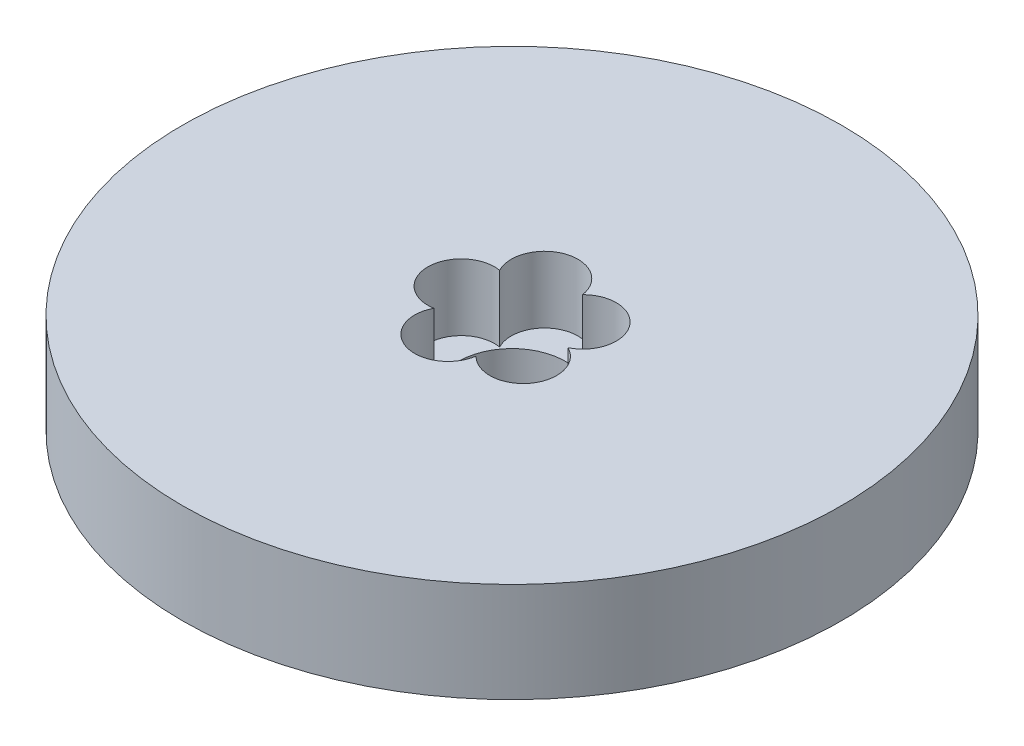
ISO-10303-21;
HEADER;
FILE_DESCRIPTION(('STEP AP214'),'2;1');
FILE_NAME('part.step','',(''),(''),'','','');
FILE_SCHEMA(('AUTOMOTIVE_DESIGN { 1 0 10303 214 1 1 1 1 }'));
ENDSEC;
DATA;
#1=APPLICATION_CONTEXT('core data for automotive mechanical design processes');
#2=APPLICATION_PROTOCOL_DEFINITION('international standard','automotive_design',2000,#1);
#3=PRODUCT_CONTEXT('',#1,'mechanical');
#4=PRODUCT('Part','Part','',(#3));
#5=PRODUCT_RELATED_PRODUCT_CATEGORY('part','',(#4));
#6=PRODUCT_DEFINITION_FORMATION('','',#4);
#7=PRODUCT_DEFINITION_CONTEXT('part definition',#1,'design');
#8=PRODUCT_DEFINITION('design','',#6,#7);
#9=PRODUCT_DEFINITION_SHAPE('','',#8);
#10=(LENGTH_UNIT() NAMED_UNIT(*) SI_UNIT(.MILLI.,.METRE.));
#11=(NAMED_UNIT(*) PLANE_ANGLE_UNIT() SI_UNIT($,.RADIAN.));
#12=(NAMED_UNIT(*) SI_UNIT($,.STERADIAN.) SOLID_ANGLE_UNIT());
#13=UNCERTAINTY_MEASURE_WITH_UNIT(LENGTH_MEASURE(1.E-05),#10,'distance_accuracy_value','');
#14=(GEOMETRIC_REPRESENTATION_CONTEXT(3) GLOBAL_UNCERTAINTY_ASSIGNED_CONTEXT((#13)) GLOBAL_UNIT_ASSIGNED_CONTEXT((#10,
#11,#12)) REPRESENTATION_CONTEXT('',''));
#15=CARTESIAN_POINT('',(0.,0.,0.));
#16=DIRECTION('',(0.,0.,1.));
#17=DIRECTION('',(1.,0.,0.));
#18=AXIS2_PLACEMENT_3D('',#15,#16,#17);
#19=CARTESIAN_POINT('',(0.,28.,0.));
#20=DIRECTION('',(0.,-1.,0.));
#21=DIRECTION('',(0.,0.,-1.));
#22=AXIS2_PLACEMENT_3D('',#19,#20,#21);
#23=CYLINDRICAL_SURFACE('',#22,15.);
#24=CARTESIAN_POINT('',(0.,0.,0.));
#25=DIRECTION('',(0.,1.,0.));
#26=DIRECTION('',(0.,0.,1.));
#27=AXIS2_PLACEMENT_3D('',#24,#25,#26);
#28=CIRCLE('',#27,15.);
#29=CARTESIAN_POINT('',(0.,0.,15.));
#30=VERTEX_POINT('',#29);
#31=EDGE_CURVE('E129',#30,#30,#28,.T.);
#32=ORIENTED_EDGE('',*,*,#31,.F.);
#33=EDGE_LOOP('',(#32));
#34=FACE_BOUND('',#33,.T.);
#35=CARTESIAN_POINT('',(0.,9.34154381881042,0.));
#36=DIRECTION('',(0.,1.,0.));
#37=DIRECTION('',(0.,0.,1.));
#38=AXIS2_PLACEMENT_3D('',#35,#36,#37);
#39=CIRCLE('',#38,15.);
#40=CARTESIAN_POINT('',(0.,9.34154381881042,15.));
#41=VERTEX_POINT('',#40);
#42=EDGE_CURVE('E11',#41,#41,#39,.T.);
#43=ORIENTED_EDGE('',*,*,#42,.T.);
#44=EDGE_LOOP('',(#43));
#45=FACE_BOUND('',#44,.T.);
#46=ADVANCED_FACE('F39',(#34,#45),#23,.F.);
#47=CARTESIAN_POINT('',(0.,28.,0.));
#48=DIRECTION('',(0.,-1.,0.));
#49=DIRECTION('',(0.,0.,-1.));
#50=AXIS2_PLACEMENT_3D('',#47,#48,#49);
#51=CYLINDRICAL_SURFACE('',#50,92.5);
#52=CARTESIAN_POINT('',(0.,28.,0.));
#53=DIRECTION('',(0.,1.,0.));
#54=DIRECTION('',(0.,0.,1.));
#55=AXIS2_PLACEMENT_3D('',#52,#53,#54);
#56=CIRCLE('',#55,92.5);
#57=CARTESIAN_POINT('',(0.,28.,92.5));
#58=VERTEX_POINT('',#57);
#59=EDGE_CURVE('E50',#58,#58,#56,.T.);
#60=ORIENTED_EDGE('',*,*,#59,.F.);
#61=EDGE_LOOP('',(#60));
#62=FACE_BOUND('',#61,.T.);
#63=CARTESIAN_POINT('',(0.,0.,0.));
#64=DIRECTION('',(0.,1.,0.));
#65=DIRECTION('',(0.,0.,1.));
#66=AXIS2_PLACEMENT_3D('',#63,#64,#65);
#67=CIRCLE('',#66,92.5);
#68=CARTESIAN_POINT('',(0.,0.,92.5));
#69=VERTEX_POINT('',#68);
#70=EDGE_CURVE('E133',#69,#69,#67,.T.);
#71=ORIENTED_EDGE('',*,*,#70,.T.);
#72=EDGE_LOOP('',(#71));
#73=FACE_BOUND('',#72,.T.);
#74=ADVANCED_FACE('F41',(#62,#73),#51,.T.);
#75=CARTESIAN_POINT('',(0.,28.,0.));
#76=DIRECTION('',(0.,1.,0.));
#77=DIRECTION('',(0.,0.,1.));
#78=AXIS2_PLACEMENT_3D('',#75,#76,#77);
#79=PLANE('',#78);
#80=CARTESIAN_POINT('',(-4.40344690659952,28.,13.5524160512668));
#81=DIRECTION('',(0.,1.,0.));
#82=DIRECTION('',(0.951056516295155,0.,0.309016994374945));
#83=AXIS2_PLACEMENT_3D('',#80,#81,#82);
#84=CIRCLE('',#83,9.36636293219436);
#85=CARTESIAN_POINT('',(-12.718142529262,28.,9.24027142474254));
#86=VERTEX_POINT('',#85);
#87=CARTESIAN_POINT('',(4.8578981724126,28.,14.9510732305078));
#88=VERTEX_POINT('',#87);
#89=EDGE_CURVE('E119',#86,#88,#84,.T.);
#90=ORIENTED_EDGE('',*,*,#89,.F.);
#91=CARTESIAN_POINT('',(-14.2498535250673,28.,0.));
#92=DIRECTION('',(0.,1.,0.));
#93=DIRECTION('',(0.,0.,1.));
#94=AXIS2_PLACEMENT_3D('',#91,#92,#93);
#95=CIRCLE('',#94,9.36636293219436);
#96=CARTESIAN_POINT('',(-12.7181425292622,28.,-9.24027142474258));
#97=VERTEX_POINT('',#96);
#98=EDGE_CURVE('E127',#97,#86,#95,.T.);
#99=ORIENTED_EDGE('',*,*,#98,.F.);
#100=CARTESIAN_POINT('',(-4.40344690659971,28.,-13.5524160512667));
#101=DIRECTION('',(0.,1.,0.));
#102=DIRECTION('',(-0.95105651629515,0.,0.309016994374958));
#103=AXIS2_PLACEMENT_3D('',#100,#101,#102);
#104=CIRCLE('',#103,9.36636293219436);
#105=CARTESIAN_POINT('',(4.85789817241239,28.,-14.9510732305079));
#106=VERTEX_POINT('',#105);
#107=EDGE_CURVE('E53',#106,#97,#104,.T.);
#108=ORIENTED_EDGE('',*,*,#107,.F.);
#109=CARTESIAN_POINT('',(11.5283736691331,28.,-8.37585374936259));
#110=DIRECTION('',(0.,1.,0.));
#111=DIRECTION('',(-0.58778525229248,0.,-0.809016994374942));
#112=AXIS2_PLACEMENT_3D('',#109,#110,#111);
#113=CIRCLE('',#112,9.36636293219436);
#114=CARTESIAN_POINT('',(15.720488713699,28.,-1.14491749414469E-13));
#115=VERTEX_POINT('',#114);
#116=EDGE_CURVE('E99',#115,#106,#113,.T.);
#117=ORIENTED_EDGE('',*,*,#116,.F.);
#118=CARTESIAN_POINT('',(11.5283736691333,28.,8.37585374936242));
#119=DIRECTION('',(0.,1.,0.));
#120=DIRECTION('',(0.587785252292469,0.,-0.809016994374951));
#121=AXIS2_PLACEMENT_3D('',#118,#119,#120);
#122=CIRCLE('',#121,9.36636293219436);
#123=EDGE_CURVE('E113',#88,#115,#122,.T.);
#124=ORIENTED_EDGE('',*,*,#123,.F.);
#125=EDGE_LOOP('',(#90,#99,#108,#117,#124));
#126=FACE_BOUND('',#125,.T.);
#127=ORIENTED_EDGE('',*,*,#59,.T.);
#128=EDGE_LOOP('',(#127));
#129=FACE_BOUND('',#128,.T.);
#130=ADVANCED_FACE('F141',(#126,#129),#79,.T.);
#131=CARTESIAN_POINT('',(0.,0.,0.));
#132=DIRECTION('',(0.,1.,0.));
#133=DIRECTION('',(0.,0.,1.));
#134=AXIS2_PLACEMENT_3D('',#131,#132,#133);
#135=PLANE('',#134);
#136=ORIENTED_EDGE('',*,*,#31,.T.);
#137=EDGE_LOOP('',(#136));
#138=FACE_BOUND('',#137,.T.);
#139=ORIENTED_EDGE('',*,*,#70,.F.);
#140=EDGE_LOOP('',(#139));
#141=FACE_BOUND('',#140,.T.);
#142=ADVANCED_FACE('F139',(#138,#141),#135,.F.);
#143=CARTESIAN_POINT('',(-14.2498535250673,9.34154381881042,0.));
#144=DIRECTION('',(0.,1.,0.));
#145=DIRECTION('',(0.,0.,1.));
#146=AXIS2_PLACEMENT_3D('',#143,#144,#145);
#147=CYLINDRICAL_SURFACE('',#146,9.36636293219436);
#148=ORIENTED_EDGE('',*,*,#98,.T.);
#149=DIRECTION('',(0.,1.,0.));
#150=VECTOR('',#149,1.);
#151=CARTESIAN_POINT('',(-12.718142529262,18.6707719094052,9.24027142474254));
#152=LINE('',#151,#150);
#153=CARTESIAN_POINT('',(-12.718142529262,9.34154381881042,9.24027142474254));
#154=VERTEX_POINT('',#153);
#155=EDGE_CURVE('E65',#86,#154,#152,.F.);
#156=ORIENTED_EDGE('',*,*,#155,.T.);
#157=CARTESIAN_POINT('',(-14.2498535250673,9.34154381881042,0.));
#158=DIRECTION('',(0.,1.,0.));
#159=DIRECTION('',(0.,0.,1.));
#160=AXIS2_PLACEMENT_3D('',#157,#158,#159);
#161=CIRCLE('',#160,9.36636293219436);
#162=CARTESIAN_POINT('',(-12.7181425292623,9.34154381881042,-9.24027142474258));
#163=VERTEX_POINT('',#162);
#164=EDGE_CURVE('E130',#163,#154,#161,.T.);
#165=ORIENTED_EDGE('',*,*,#164,.F.);
#166=DIRECTION('',(0.,1.,0.));
#167=VECTOR('',#166,1.);
#168=CARTESIAN_POINT('',(-12.7181425292623,18.6707719094052,-9.24027142474258));
#169=LINE('',#168,#167);
#170=EDGE_CURVE('E108',#163,#97,#169,.T.);
#171=ORIENTED_EDGE('',*,*,#170,.T.);
#172=EDGE_LOOP('',(#148,#156,#165,#171));
#173=FACE_BOUND('',#172,.T.);
#174=ADVANCED_FACE('F142',(#173),#147,.F.);
#175=CARTESIAN_POINT('',(-14.2498535250673,9.34154381881042,0.));
#176=DIRECTION('',(0.,1.,0.));
#177=DIRECTION('',(0.,0.,1.));
#178=AXIS2_PLACEMENT_3D('',#175,#176,#177);
#179=PLANE('',#178);
#180=ORIENTED_EDGE('',*,*,#164,.T.);
#181=CARTESIAN_POINT('',(-4.40344690659952,9.34154381881042,13.5524160512668));
#182=DIRECTION('',(0.,1.,0.));
#183=DIRECTION('',(0.951056516295155,0.,0.309016994374945));
#184=AXIS2_PLACEMENT_3D('',#181,#182,#183);
#185=CIRCLE('',#184,9.36636293219436);
#186=CARTESIAN_POINT('',(4.8578981724126,9.34154381881042,14.9510732305078));
#187=VERTEX_POINT('',#186);
#188=EDGE_CURVE('E121',#154,#187,#185,.T.);
#189=ORIENTED_EDGE('',*,*,#188,.T.);
#190=CARTESIAN_POINT('',(11.5283736691333,9.34154381881042,8.37585374936242));
#191=DIRECTION('',(0.,1.,0.));
#192=DIRECTION('',(0.587785252292469,0.,-0.809016994374951));
#193=AXIS2_PLACEMENT_3D('',#190,#191,#192);
#194=CIRCLE('',#193,9.36636293219436);
#195=CARTESIAN_POINT('',(15.720488713699,9.34154381881042,-1.14491749414469E-13));
#196=VERTEX_POINT('',#195);
#197=EDGE_CURVE('E92',#187,#196,#194,.T.);
#198=ORIENTED_EDGE('',*,*,#197,.T.);
#199=CARTESIAN_POINT('',(11.5283736691331,9.34154381881042,-8.37585374936259));
#200=DIRECTION('',(0.,1.,0.));
#201=DIRECTION('',(-0.58778525229248,0.,-0.809016994374942));
#202=AXIS2_PLACEMENT_3D('',#199,#200,#201);
#203=CIRCLE('',#202,9.36636293219436);
#204=CARTESIAN_POINT('',(4.85789817241239,9.34154381881042,-14.9510732305079));
#205=VERTEX_POINT('',#204);
#206=EDGE_CURVE('E88',#196,#205,#203,.T.);
#207=ORIENTED_EDGE('',*,*,#206,.T.);
#208=CARTESIAN_POINT('',(-4.40344690659971,9.34154381881042,-13.5524160512667));
#209=DIRECTION('',(0.,1.,0.));
#210=DIRECTION('',(-0.95105651629515,0.,0.309016994374958));
#211=AXIS2_PLACEMENT_3D('',#208,#209,#210);
#212=CIRCLE('',#211,9.36636293219436);
#213=EDGE_CURVE('E95',#205,#163,#212,.T.);
#214=ORIENTED_EDGE('',*,*,#213,.T.);
#215=EDGE_LOOP('',(#180,#189,#198,#207,#214));
#216=FACE_BOUND('',#215,.T.);
#217=ORIENTED_EDGE('',*,*,#42,.F.);
#218=EDGE_LOOP('',(#217));
#219=FACE_BOUND('',#218,.T.);
#220=ADVANCED_FACE('F90',(#216,#219),#179,.T.);
#221=CARTESIAN_POINT('',(-4.40344690659952,9.34154381881042,13.5524160512668));
#222=DIRECTION('',(0.,1.,0.));
#223=DIRECTION('',(0.,0.,1.));
#224=AXIS2_PLACEMENT_3D('',#221,#222,#223);
#225=CYLINDRICAL_SURFACE('',#224,9.36636293219436);
#226=ORIENTED_EDGE('',*,*,#89,.T.);
#227=DIRECTION('',(0.,1.,0.));
#228=VECTOR('',#227,1.);
#229=CARTESIAN_POINT('',(4.8578981724126,18.6707719094052,14.9510732305078));
#230=LINE('',#229,#228);
#231=EDGE_CURVE('E106',#88,#187,#230,.F.);
#232=ORIENTED_EDGE('',*,*,#231,.T.);
#233=ORIENTED_EDGE('',*,*,#188,.F.);
#234=ORIENTED_EDGE('',*,*,#155,.F.);
#235=EDGE_LOOP('',(#226,#232,#233,#234));
#236=FACE_BOUND('',#235,.T.);
#237=ADVANCED_FACE('F164',(#236),#225,.F.);
#238=CARTESIAN_POINT('',(-4.40344690659971,9.34154381881042,-13.5524160512667));
#239=DIRECTION('',(0.,1.,0.));
#240=DIRECTION('',(0.,0.,1.));
#241=AXIS2_PLACEMENT_3D('',#238,#239,#240);
#242=CYLINDRICAL_SURFACE('',#241,9.36636293219436);
#243=ORIENTED_EDGE('',*,*,#213,.F.);
#244=DIRECTION('',(0.,1.,0.));
#245=VECTOR('',#244,1.);
#246=CARTESIAN_POINT('',(4.85789817241239,18.6707719094052,-14.9510732305079));
#247=LINE('',#246,#245);
#248=EDGE_CURVE('E103',#106,#205,#247,.F.);
#249=ORIENTED_EDGE('',*,*,#248,.F.);
#250=ORIENTED_EDGE('',*,*,#107,.T.);
#251=ORIENTED_EDGE('',*,*,#170,.F.);
#252=EDGE_LOOP('',(#243,#249,#250,#251));
#253=FACE_BOUND('',#252,.T.);
#254=ADVANCED_FACE('F107',(#253),#242,.F.);
#255=CARTESIAN_POINT('',(11.5283736691333,9.34154381881042,8.37585374936242));
#256=DIRECTION('',(0.,1.,0.));
#257=DIRECTION('',(0.,0.,1.));
#258=AXIS2_PLACEMENT_3D('',#255,#256,#257);
#259=CYLINDRICAL_SURFACE('',#258,9.36636293219436);
#260=ORIENTED_EDGE('',*,*,#123,.T.);
#261=DIRECTION('',(0.,1.,0.));
#262=VECTOR('',#261,1.);
#263=CARTESIAN_POINT('',(15.720488713699,18.6707719094052,-1.14491749414469E-13));
#264=LINE('',#263,#262);
#265=EDGE_CURVE('E97',#115,#196,#264,.F.);
#266=ORIENTED_EDGE('',*,*,#265,.T.);
#267=ORIENTED_EDGE('',*,*,#197,.F.);
#268=ORIENTED_EDGE('',*,*,#231,.F.);
#269=EDGE_LOOP('',(#260,#266,#267,#268));
#270=FACE_BOUND('',#269,.T.);
#271=ADVANCED_FACE('F169',(#270),#259,.F.);
#272=CARTESIAN_POINT('',(11.5283736691331,9.34154381881042,-8.37585374936259));
#273=DIRECTION('',(0.,1.,0.));
#274=DIRECTION('',(0.,0.,1.));
#275=AXIS2_PLACEMENT_3D('',#272,#273,#274);
#276=CYLINDRICAL_SURFACE('',#275,9.36636293219436);
#277=ORIENTED_EDGE('',*,*,#248,.T.);
#278=ORIENTED_EDGE('',*,*,#206,.F.);
#279=ORIENTED_EDGE('',*,*,#265,.F.);
#280=ORIENTED_EDGE('',*,*,#116,.T.);
#281=EDGE_LOOP('',(#277,#278,#279,#280));
#282=FACE_BOUND('',#281,.T.);
#283=ADVANCED_FACE('F102',(#282),#276,.F.);
#284=CLOSED_SHELL('',(#46,#74,#130,#142,#174,#220,#237,#254,#271,#283));
#285=MANIFOLD_SOLID_BREP('B2',#284);
#286=ADVANCED_BREP_SHAPE_REPRESENTATION('',(#18,#285),#14);
#287=SHAPE_DEFINITION_REPRESENTATION(#9,#286);
ENDSEC;
END-ISO-10303-21;
